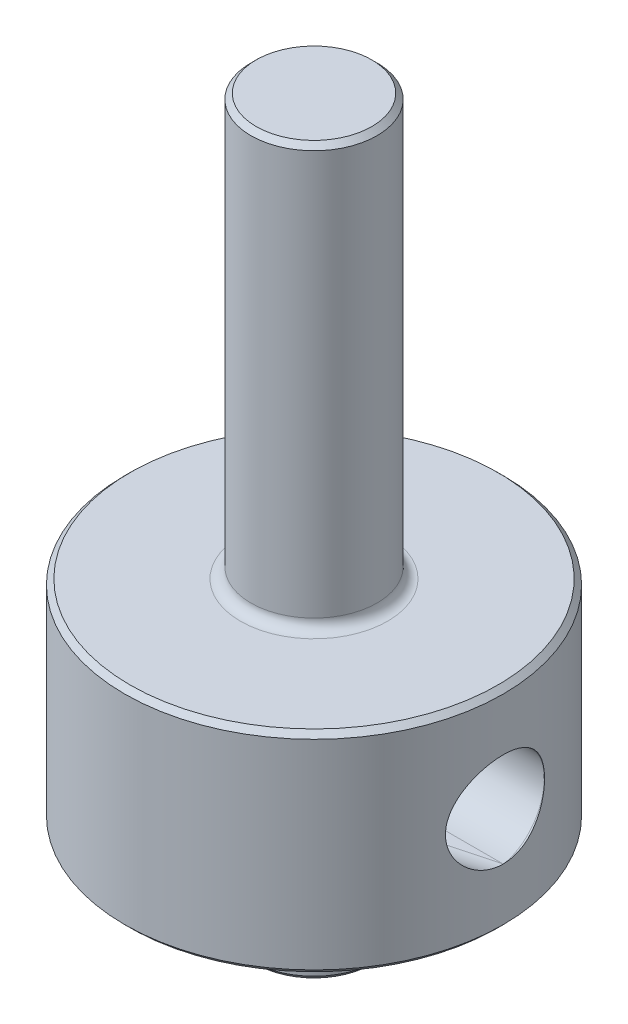
ISO-10303-21;
HEADER;
FILE_DESCRIPTION(('STEP AP214'),'2;1');
FILE_NAME('part.step','',(''),(''),'','','');
FILE_SCHEMA(('AUTOMOTIVE_DESIGN { 1 0 10303 214 1 1 1 1 }'));
ENDSEC;
DATA;
#1=APPLICATION_CONTEXT('core data for automotive mechanical design processes');
#2=APPLICATION_PROTOCOL_DEFINITION('international standard','automotive_design',2000,#1);
#3=PRODUCT_CONTEXT('',#1,'mechanical');
#4=PRODUCT('Part','Part','',(#3));
#5=PRODUCT_RELATED_PRODUCT_CATEGORY('part','',(#4));
#6=PRODUCT_DEFINITION_FORMATION('','',#4);
#7=PRODUCT_DEFINITION_CONTEXT('part definition',#1,'design');
#8=PRODUCT_DEFINITION('design','',#6,#7);
#9=PRODUCT_DEFINITION_SHAPE('','',#8);
#10=(LENGTH_UNIT() NAMED_UNIT(*) SI_UNIT(.MILLI.,.METRE.));
#11=(NAMED_UNIT(*) PLANE_ANGLE_UNIT() SI_UNIT($,.RADIAN.));
#12=(NAMED_UNIT(*) SI_UNIT($,.STERADIAN.) SOLID_ANGLE_UNIT());
#13=UNCERTAINTY_MEASURE_WITH_UNIT(LENGTH_MEASURE(1.E-05),#10,'distance_accuracy_value','');
#14=(GEOMETRIC_REPRESENTATION_CONTEXT(3) GLOBAL_UNCERTAINTY_ASSIGNED_CONTEXT((#13)) GLOBAL_UNIT_ASSIGNED_CONTEXT((#10,
#11,#12)) REPRESENTATION_CONTEXT('',''));
#15=CARTESIAN_POINT('',(0.,0.,0.));
#16=DIRECTION('',(0.,0.,1.));
#17=DIRECTION('',(1.,0.,0.));
#18=AXIS2_PLACEMENT_3D('',#15,#16,#17);
#19=CARTESIAN_POINT('',(11.25,0.,-0.602885682970027));
#20=DIRECTION('',(-0.965925826289068,0.,0.258819045102521));
#21=DIRECTION('',(0.258819045102521,0.,0.965925826289068));
#22=AXIS2_PLACEMENT_3D('',#19,#20,#21);
#23=CYLINDRICAL_SURFACE('',#22,2.25);
#24=DIRECTION('',(0.965925826289068,0.,-0.258819045102521));
#25=VECTOR('',#24,1.);
#26=CARTESIAN_POINT('',(-10.4287614698095,-2.25,5.20592094577239));
#27=LINE('',#26,#25);
#28=CARTESIAN_POINT('',(-7.79422863405994,-2.25,4.50000000000001));
#29=VERTEX_POINT('',#28);
#30=CARTESIAN_POINT('',(9.,-2.25,0.));
#31=VERTEX_POINT('',#30);
#32=EDGE_CURVE('E68',#29,#31,#27,.T.);
#33=ORIENTED_EDGE('',*,*,#32,.F.);
#34=CARTESIAN_POINT('',(-6.2986309684237,0.,6.42862721921359));
#35=CARTESIAN_POINT('',(-6.29863572562921,0.115420645557257,6.42862440706099));
#36=CARTESIAN_POINT('',(-6.3060602838156,0.230878962906398,6.42137370973188));
#37=CARTESIAN_POINT('',(-6.33512109848462,0.458218917145718,6.39270188036306));
#38=CARTESIAN_POINT('',(-6.3567683340453,0.570097720835036,6.37126980103204));
#39=CARTESIAN_POINT('',(-6.41242453029494,0.78670447934925,6.31524720562879));
#40=CARTESIAN_POINT('',(-6.44638221658226,0.891459984994621,6.2807112412774));
#41=CARTESIAN_POINT('',(-6.52441532590811,1.09212368629617,6.19960971245666));
#42=CARTESIAN_POINT('',(-6.56849300705771,1.18802990067239,6.15304146288881));
#43=CARTESIAN_POINT('',(-6.66787542719835,1.37599197932501,6.04526066182345));
#44=CARTESIAN_POINT('',(-6.72376022801728,1.46727267152965,5.98323478487839));
#45=CARTESIAN_POINT('',(-6.84174874506253,1.63651923315656,5.8479513900165));
#46=CARTESIAN_POINT('',(-6.90385527941814,1.71447902523652,5.77468877437664));
#47=CARTESIAN_POINT('',(-7.03939861788815,1.86424788131121,5.60888743463547));
#48=CARTESIAN_POINT('',(-7.11330801596242,1.93424855635128,5.51509447487221));
#49=CARTESIAN_POINT('',(-7.26276858582111,2.05452364569838,5.31673000401393));
#50=CARTESIAN_POINT('',(-7.33832026687979,2.1047918461138,5.2121551106831));
#51=CARTESIAN_POINT('',(-7.49057807446588,2.18518458802696,4.99097133267823));
#52=CARTESIAN_POINT('',(-7.56724722608848,2.2146353310375,4.87408964345249));
#53=CARTESIAN_POINT('',(-7.71646007617075,2.24913379886119,4.63423781835183));
#54=CARTESIAN_POINT('',(-7.78900533974565,2.25419084360776,4.51127002589661));
#55=CARTESIAN_POINT('',(-7.92385182822738,2.23921005722015,4.26974209030992));
#56=CARTESIAN_POINT('',(-7.98649124915509,2.22047892995192,4.15129057209001));
#57=CARTESIAN_POINT('',(-8.10419519406083,2.15996401217146,3.91653502097405));
#58=CARTESIAN_POINT('',(-8.15926253547756,2.11818882510589,3.80023020334988));
#59=CARTESIAN_POINT('',(-8.25776113353527,2.01560967239164,3.58092038777548));
#60=CARTESIAN_POINT('',(-8.30169093853679,1.95609127547807,3.47753592764894));
#61=CARTESIAN_POINT('',(-8.38164675783941,1.81895528829501,3.28014439330143));
#62=CARTESIAN_POINT('',(-8.4176735688114,1.74133952398132,3.18613637439842));
#63=CARTESIAN_POINT('',(-8.4813766537205,1.57178662880977,3.0124201997295));
#64=CARTESIAN_POINT('',(-8.50919398505658,1.48013832272008,2.93248136388814));
#65=CARTESIAN_POINT('',(-8.55778682532547,1.28408324493627,2.78749818442494));
#66=CARTESIAN_POINT('',(-8.5785620965331,1.17967604269037,2.72245434365095));
#67=CARTESIAN_POINT('',(-8.61377201375056,0.960065530946159,2.608929002455));
#68=CARTESIAN_POINT('',(-8.62815045340775,0.844776908229934,2.56059511952854));
#69=CARTESIAN_POINT('',(-8.65083340110135,0.607411382763265,2.48288750415837));
#70=CARTESIAN_POINT('',(-8.65913768828506,0.48533423335953,2.45351446112445));
#71=CARTESIAN_POINT('',(-8.67008048728678,0.236857570319108,2.41456499172959));
#72=CARTESIAN_POINT('',(-8.67267544790419,0.110432252928291,2.40514075696676));
#73=CARTESIAN_POINT('',(-8.67219751366162,-0.142268545365695,2.40686318857274));
#74=CARTESIAN_POINT('',(-8.66912451553204,-0.268544023496865,2.41801022974793));
#75=CARTESIAN_POINT('',(-8.65715387573318,-0.51751785461279,2.46052203867228));
#76=CARTESIAN_POINT('',(-8.64824925913011,-0.640211740022708,2.49191101619238));
#77=CARTESIAN_POINT('',(-8.62421236615811,-0.878377270072895,2.57386329992728));
#78=CARTESIAN_POINT('',(-8.60908000496078,-0.993848816312671,2.6244268673193));
#79=CARTESIAN_POINT('',(-8.57205213944146,-1.21415256544937,2.74294663140657));
#80=CARTESIAN_POINT('',(-8.55016367391666,-1.31899569116797,2.81088471402045));
#81=CARTESIAN_POINT('',(-8.49904486992793,-1.51515452308034,2.96185190294187));
#82=CARTESIAN_POINT('',(-8.46981504685822,-1.60647117817417,3.04487994975732));
#83=CARTESIAN_POINT('',(-8.40384326654009,-1.77231366502419,3.22246844850753));
#84=CARTESIAN_POINT('',(-8.36716006476566,-1.84696178407205,3.31693649876167));
#85=CARTESIAN_POINT('',(-8.28606008973115,-1.97828129373805,3.51462690249678));
#86=CARTESIAN_POINT('',(-8.24164420023817,-2.03495473659138,3.61784825487416));
#87=CARTESIAN_POINT('',(-8.14587050991866,-2.12853459341272,3.82858464031527));
#88=CARTESIAN_POINT('',(-8.09457748565701,-2.1656111713848,3.93605369911621));
#89=CARTESIAN_POINT('',(-7.98560105577117,-2.2201622548549,4.15269515826185));
#90=CARTESIAN_POINT('',(-7.92791726302396,-2.23763557216455,4.26186766144874));
#91=CARTESIAN_POINT('',(-7.8064627399753,-2.2532286711866,4.48051702474105));
#92=CARTESIAN_POINT('',(-7.74260781604153,-2.25102691326248,4.58996960492615));
#93=CARTESIAN_POINT('',(-7.61133141525705,-2.22723790138716,4.80452612877819));
#94=CARTESIAN_POINT('',(-7.54390907227507,-2.20564591918363,4.90962900524241));
#95=CARTESIAN_POINT('',(-7.40368700760956,-2.14247693844326,5.11880139853706));
#96=CARTESIAN_POINT('',(-7.33079536390484,-2.09986710762043,5.22249687911003));
#97=CARTESIAN_POINT('',(-7.18566990287537,-1.99573590270148,5.4204461433094));
#98=CARTESIAN_POINT('',(-7.11343636939443,-1.9342067325446,5.51469601343077));
#99=CARTESIAN_POINT('',(-6.96808985738204,-1.78946346248777,5.6973807162314));
#100=CARTESIAN_POINT('',(-6.89518353138152,-1.70517091423079,5.78512871402776));
#101=CARTESIAN_POINT('',(-6.75667498207226,-1.51863287423206,5.94631447067187));
#102=CARTESIAN_POINT('',(-6.69107582137067,-1.41637990076989,6.01974623884784));
#103=CARTESIAN_POINT('',(-6.57183008781377,-1.19703132919625,6.14969612074954));
#104=CARTESIAN_POINT('',(-6.51807249243096,-1.08009130507524,6.20637320763919));
#105=CARTESIAN_POINT('',(-6.42605821431225,-0.833521771282112,6.30160344845743));
#106=CARTESIAN_POINT('',(-6.38776882517395,-0.703919763209804,6.34019487118341));
#107=CARTESIAN_POINT('',(-6.33934183170501,-0.477861263387974,6.38854526595828));
#108=CARTESIAN_POINT('',(-6.32415889206565,-0.38356198653444,6.40353131951988));
#109=CARTESIAN_POINT('',(-6.30380294632094,-0.192850152597827,6.42357200922269));
#110=CARTESIAN_POINT('',(-6.29862699360223,-0.096438226055408,6.42862956887129));
#111=CARTESIAN_POINT('',(-6.2986309684237,0.,6.42862721921359));
#112=B_SPLINE_CURVE_WITH_KNOTS('',3,(#34,#35,#36,#37,#38,#39,#40,#41,#42,#43,#44,#45,#46,#47,
#48,#49,#50,#51,#52,#53,#54,#55,#56,#57,#58,#59,#60,#61,#62,#63,#64,#65,#66,#67,#68,#69,#70,#71,
#72,#73,#74,#75,#76,#77,#78,#79,#80,#81,#82,#83,#84,#85,#86,#87,#88,#89,#90,#91,#92,#93,#94,#95,
#96,#97,#98,#99,#100,#101,#102,#103,#104,#105,#106,#107,#108,#109,#110,#111),.UNSPECIFIED.,.T.,
.F.,(4,2,2,2,2,2,2,2,2,2,2,2,2,2,2,2,2,2,2,2,2,2,2,2,2,2,2,2,2,2,2,2,2,2,2,2,2,2,4),(0.,
0.345877961457703,0.692023234739048,1.03674303415902,1.38153982703779,1.75117699978304,
2.12098236297531,2.53438092029154,2.94790955541439,3.37427601824992,3.8004795692583,
4.204252580168,4.6078749452831,4.98738996171283,5.36686670307259,5.73938241737213,
6.11191070576972,6.48765054778276,6.86340405080125,7.24201403637019,7.62063092023952,
7.99970147963442,8.37877720253762,8.757459313711,9.13611484723242,9.51189379136419,
9.88762981596775,10.2600472924912,10.6324873406787,11.0110249766264,11.389654942997,
11.7890874589759,12.1886847895261,12.6122260505673,13.0359441651727,13.455502400953,
13.8741688086731,14.1632477952196,14.452241647867),.UNSPECIFIED.);
#113=CARTESIAN_POINT('',(-7.79422863405994,2.25,4.50000000000001));
#114=VERTEX_POINT('',#113);
#115=EDGE_CURVE('E100',#29,#114,#112,.T.);
#116=ORIENTED_EDGE('',*,*,#115,.T.);
#117=DIRECTION('',(0.965925826289068,0.,-0.258819045102521));
#118=VECTOR('',#117,1.);
#119=CARTESIAN_POINT('',(-10.4287614698095,2.25,5.20592094577239));
#120=LINE('',#119,#118);
#121=CARTESIAN_POINT('',(9.,2.25,0.));
#122=VERTEX_POINT('',#121);
#123=EDGE_CURVE('E96',#114,#122,#120,.T.);
#124=ORIENTED_EDGE('',*,*,#123,.T.);
#125=CARTESIAN_POINT('',(8.66908803732511,0.,2.41803899908722));
#126=CARTESIAN_POINT('',(8.66909075110963,-0.115420645557257,2.41803418508887));
#127=CARTESIAN_POINT('',(8.67189525844636,-0.230878962906399,2.40804261791352));
#128=CARTESIAN_POINT('',(8.68272674751999,-0.458218917145718,2.36868167797264));
#129=CARTESIAN_POINT('',(8.69075776377174,-0.570097720835037,2.33929733503571));
#130=CARTESIAN_POINT('',(8.71094614590031,-0.786704479349251,2.26295224610574));
#131=CARTESIAN_POINT('',(8.72308638270318,-0.891459984994622,2.21606438048958));
#132=CARTESIAN_POINT('',(8.75011427330529,-1.09212368629617,2.10681184158214));
#133=CARTESIAN_POINT('',(8.76500254013682,-1.18802990067239,2.04444371387181));
#134=CARTESIAN_POINT('',(8.79717984013551,-1.37599197932501,1.90141159203865));
#135=CARTESIAN_POINT('',(8.81456455885762,-1.46727267152965,1.81975320650276));
#136=CARTESIAN_POINT('',(8.84910391454271,-1.63651923315656,1.64360009131953));
#137=CARTESIAN_POINT('',(8.86625844321575,-1.71447902523652,1.54909953784991));
#138=CARTESIAN_POINT('',(8.90074174777394,-1.86424788131121,1.33773969641756));
#139=CARTESIAN_POINT('',(8.91785268420305,-1.93424855635128,1.21955791152931));
#140=CARTESIAN_POINT('',(8.94810709913564,-2.05452364569838,0.973038955628435));
#141=CARTESIAN_POINT('',(8.96124932756565,-2.1047918461138,0.844698600876546));
#142=CARTESIAN_POINT('',(8.9825165678573,-2.18518458802696,0.577018926426272));
#143=CARTESIAN_POINT('',(8.99047315623619,-2.21463533103751,0.437461838508236));
#144=CARTESIAN_POINT('',(8.99976936242818,-2.24913379886119,0.155137639785871));
#145=CARTESIAN_POINT('',(9.00111150738068,-2.25419084360776,0.0123717758849108));
#146=CARTESIAN_POINT('',(8.99712802422364,-2.23921005722015,-0.264220796297641));
#147=CARTESIAN_POINT('',(8.99214959491542,-2.22047892995192,-0.398122530656776));
#148=CARTESIAN_POINT('',(8.97670642577146,-2.15996401217146,-0.660278774055481));
#149=CARTESIAN_POINT('',(8.96624373354513,-2.11818882510589,-0.788535371408894));
#150=CARTESIAN_POINT('',(8.94189111391307,-2.01560967239164,-1.02771254202446));
#151=CARTESIAN_POINT('',(8.92824321096441,-1.95609127547807,-1.13921101335134));
#152=CARTESIAN_POINT('',(8.89879121448712,-1.81895528829501,-1.35013500623958));
#153=CARTESIAN_POINT('',(8.8829873385547,-1.74133952398132,-1.44956174425504));
#154=CARTESIAN_POINT('',(8.85129774105095,-1.57178662880977,-1.63185590702113));
#155=CARTESIAN_POINT('',(8.83541883873281,-1.48013832272008,-1.71499363527673));
#156=CARTESIAN_POINT('',(8.80500988311611,-1.28408324493627,-1.86484917194776));
#157=CARTESIAN_POINT('',(8.79047987536543,-1.17967604269037,-1.93156642602155));
#158=CARTESIAN_POINT('',(8.76420988754292,-0.960065530946158,-2.04748721407927));
#159=CARTESIAN_POINT('',(8.7524950400896,-0.844776908229933,-2.09653480438572));
#160=CARTESIAN_POINT('',(8.73328524133988,-0.607411382763264,-2.1751730472106));
#161=CARTESIAN_POINT('',(8.72579044348435,-0.485334233359529,-2.20476299225628));
#162=CARTESIAN_POINT('',(8.7157924507109,-0.236857570319107,-2.24396562171702));
#163=CARTESIAN_POINT('',(8.71332763514599,-0.110432252928291,-2.25342472874156));
#164=CARTESIAN_POINT('',(8.71377494775357,0.142268545365696,-2.25169409209321));
#165=CARTESIAN_POINT('',(8.71668717389518,0.268544023496866,-2.24050397219368));
#166=CARTESIAN_POINT('',(8.72757620019198,0.517517854612791,-2.19770234580494));
#167=CARTESIAN_POINT('',(8.73555906476282,0.64021174002271,-2.16606638557217));
#168=CARTESIAN_POINT('',(8.75571864668846,0.878377270072896,-2.08307517947359));
#169=CARTESIAN_POINT('',(8.76789542116834,0.993848816312672,-2.03171966500748));
#170=CARTESIAN_POINT('',(8.79508823102433,1.21415256544937,-1.91056460569769));
#171=CARTESIAN_POINT('',(8.81010130513694,1.31899569116797,-1.84078426750727));
#172=CARTESIAN_POINT('',(8.84131471673233,1.51515452308034,-1.68448344476903));
#173=CARTESIAN_POINT('',(8.85751497081356,1.60647117817417,-1.5979641354654));
#174=CARTESIAN_POINT('',(8.88917598250028,1.77231366502419,-1.41118209396871));
#175=CARTESIAN_POINT('',(8.90464142299854,1.84696178407205,-1.31102876171542));
#176=CARTESIAN_POINT('',(8.93325198623993,1.97828129373805,-1.09927386247916));
#177=CARTESIAN_POINT('',(8.94639737379601,2.03495473659138,-0.987673604360878));
#178=CARTESIAN_POINT('',(8.96882311768569,2.12853459341272,-0.757283695907411));
#179=CARTESIAN_POINT('',(8.97813658503864,2.1656111713848,-0.638566248734169));
#180=CARTESIAN_POINT('',(8.99208095791658,2.2201622548549,-0.396461026658194));
#181=CARTESIAN_POINT('',(8.99671157960431,2.23763557216455,-0.273072969130007));
#182=CARTESIAN_POINT('',(9.00085355888581,2.2532286711866,-0.0229898044732395));
#183=CARTESIAN_POINT('',(9.00027986269499,2.25102691326248,0.103726372443697));
#184=CARTESIAN_POINT('',(8.99386942662426,2.22723790138717,0.355175973039477));
#185=CARTESIAN_POINT('',(8.98803140305131,2.20564591918363,0.479908905559302));
#186=CARTESIAN_POINT('',(8.9711817295272,2.14247693844326,0.731168544255609));
#187=CARTESIAN_POINT('',(8.9599034546418,2.09986710762043,0.857417286541805));
#188=CARTESIAN_POINT('',(8.93319575075403,1.99573590270148,1.10140910851363));
#189=CARTESIAN_POINT('',(8.91776461081511,1.9342067325446,1.21914865708259));
#190=CARTESIAN_POINT('',(8.88323319046123,1.78946346248777,1.45003150659694));
#191=CARTESIAN_POINT('',(8.86396845894638,1.70517091423079,1.56247666482007));
#192=CARTESIAN_POINT('',(8.82460941492528,1.51863287423205,1.77132189945671));
#193=CARTESIAN_POINT('',(8.80451475937875,1.41637990076989,1.86771525649271));
#194=CARTESIAN_POINT('',(8.76621986577641,1.19703132919625,2.03987802221683));
#195=CARTESIAN_POINT('',(8.74800296597337,1.08009130507523,2.11584061696716));
#196=CARTESIAN_POINT('',(8.71593138402079,0.83352177128211,2.24431956378361));
#197=CARTESIAN_POINT('',(8.70206751169463,0.703919763209803,2.29688541080165));
#198=CARTESIAN_POINT('',(8.68430370250905,0.477861263387973,2.36297157769416));
#199=CARTESIAN_POINT('',(8.67864791785805,0.383561986534439,2.38354135060067));
#200=CARTESIAN_POINT('',(8.67103949657648,0.192850152597826,2.41107506986501));
#201=CARTESIAN_POINT('',(8.66908576985758,0.0964382260554076,2.41804302136122));
#202=CARTESIAN_POINT('',(8.66908803732511,0.,2.41803899908722));
#203=B_SPLINE_CURVE_WITH_KNOTS('',3,(#125,#126,#127,#128,#129,#130,#131,#132,#133,#134,#135,
#136,#137,#138,#139,#140,#141,#142,#143,#144,#145,#146,#147,#148,#149,#150,#151,#152,#153,#154,
#155,#156,#157,#158,#159,#160,#161,#162,#163,#164,#165,#166,#167,#168,#169,#170,#171,#172,#173,
#174,#175,#176,#177,#178,#179,#180,#181,#182,#183,#184,#185,#186,#187,#188,#189,#190,#191,#192,
#193,#194,#195,#196,#197,#198,#199,#200,#201,#202),.UNSPECIFIED.,.T.,.F.,(4,2,2,2,2,2,2,2,2,2,2,
2,2,2,2,2,2,2,2,2,2,2,2,2,2,2,2,2,2,2,2,2,2,2,2,2,2,2,4),(0.,0.345877961457704,
0.692023234739048,1.03674303415902,1.38153982703779,1.75117699978304,2.12098236297532,
2.53438092029155,2.94790955541439,3.37427601824992,3.8004795692583,4.204252580168,
4.6078749452831,4.98738996171283,5.36686670307259,5.73938241737213,6.11191070576972,
6.48765054778276,6.86340405080125,7.24201403637019,7.62063092023952,7.99970147963442,
8.37877720253762,8.75745931371099,9.13611484723242,9.51189379136419,9.88762981596774,
10.2600472924912,10.6324873406787,11.0110249766264,11.389654942997,11.7890874589759,
12.1886847895261,12.6122260505673,13.0359441651727,13.455502400953,13.8741688086731,
14.1632477952196,14.452241647867),.UNSPECIFIED.);
#204=EDGE_CURVE('E95',#122,#31,#203,.T.);
#205=ORIENTED_EDGE('',*,*,#204,.T.);
#206=EDGE_LOOP('',(#33,#116,#124,#205));
#207=FACE_BOUND('',#206,.T.);
#208=ADVANCED_FACE('F36',(#207),#23,.F.);
#209=CARTESIAN_POINT('',(3.,-9.5,0.));
#210=DIRECTION('',(0.,-1.,0.));
#211=DIRECTION('',(0.,0.,-1.));
#212=AXIS2_PLACEMENT_3D('',#209,#210,#211);
#213=PLANE('',#212);
#214=CARTESIAN_POINT('',(0.,-9.5,0.));
#215=DIRECTION('',(0.,-1.,0.));
#216=DIRECTION('',(0.,0.,-1.));
#217=AXIS2_PLACEMENT_3D('',#214,#215,#216);
#218=CIRCLE('',#217,2.75);
#219=CARTESIAN_POINT('',(0.,-9.5,-2.75));
#220=VERTEX_POINT('',#219);
#221=EDGE_CURVE('E139',#220,#220,#218,.T.);
#222=ORIENTED_EDGE('',*,*,#221,.T.);
#223=EDGE_LOOP('',(#222));
#224=FACE_BOUND('',#223,.T.);
#225=ADVANCED_FACE('F184',(#224),#213,.T.);
#226=CARTESIAN_POINT('',(0.,25.,0.));
#227=DIRECTION('',(0.,1.,0.));
#228=DIRECTION('',(0.,0.,1.));
#229=AXIS2_PLACEMENT_3D('',#226,#227,#228);
#230=PLANE('',#229);
#231=CARTESIAN_POINT('',(0.,25.,0.));
#232=DIRECTION('',(0.,1.,0.));
#233=DIRECTION('',(0.,0.,1.));
#234=AXIS2_PLACEMENT_3D('',#231,#232,#233);
#235=CIRCLE('',#234,2.75);
#236=CARTESIAN_POINT('',(0.,25.,2.75));
#237=VERTEX_POINT('',#236);
#238=EDGE_CURVE('E148',#237,#237,#235,.T.);
#239=ORIENTED_EDGE('',*,*,#238,.T.);
#240=EDGE_LOOP('',(#239));
#241=FACE_BOUND('',#240,.T.);
#242=ADVANCED_FACE('F188',(#241),#230,.T.);
#243=CARTESIAN_POINT('',(0.,0.,0.));
#244=DIRECTION('',(0.,-1.,0.));
#245=DIRECTION('',(0.,0.,-1.));
#246=AXIS2_PLACEMENT_3D('',#243,#244,#245);
#247=CYLINDRICAL_SURFACE('',#246,3.);
#248=CARTESIAN_POINT('',(0.,24.75,0.));
#249=DIRECTION('',(0.,1.,0.));
#250=DIRECTION('',(0.,0.,1.));
#251=AXIS2_PLACEMENT_3D('',#248,#249,#250);
#252=CIRCLE('',#251,3.);
#253=CARTESIAN_POINT('',(0.,24.75,3.));
#254=VERTEX_POINT('',#253);
#255=EDGE_CURVE('E145',#254,#254,#252,.F.);
#256=ORIENTED_EDGE('',*,*,#255,.T.);
#257=EDGE_LOOP('',(#256));
#258=FACE_BOUND('',#257,.T.);
#259=CARTESIAN_POINT('',(0.,5.5,0.));
#260=DIRECTION('',(0.,1.,0.));
#261=DIRECTION('',(0.,0.,1.));
#262=AXIS2_PLACEMENT_3D('',#259,#260,#261);
#263=CIRCLE('',#262,3.);
#264=CARTESIAN_POINT('',(0.,5.5,3.));
#265=VERTEX_POINT('',#264);
#266=EDGE_CURVE('E136',#265,#265,#263,.T.);
#267=ORIENTED_EDGE('',*,*,#266,.T.);
#268=EDGE_LOOP('',(#267));
#269=FACE_BOUND('',#268,.T.);
#270=ADVANCED_FACE('F194',(#258,#269),#247,.T.);
#271=CARTESIAN_POINT('',(9.,5.,0.));
#272=DIRECTION('',(0.,1.,0.));
#273=DIRECTION('',(0.,0.,1.));
#274=AXIS2_PLACEMENT_3D('',#271,#272,#273);
#275=PLANE('',#274);
#276=CARTESIAN_POINT('',(0.,5.,0.));
#277=DIRECTION('',(0.,1.,0.));
#278=DIRECTION('',(0.,0.,1.));
#279=AXIS2_PLACEMENT_3D('',#276,#277,#278);
#280=CIRCLE('',#279,8.75);
#281=CARTESIAN_POINT('',(0.,5.,8.75));
#282=VERTEX_POINT('',#281);
#283=EDGE_CURVE('E11',#282,#282,#280,.T.);
#284=ORIENTED_EDGE('',*,*,#283,.T.);
#285=EDGE_LOOP('',(#284));
#286=FACE_BOUND('',#285,.T.);
#287=CARTESIAN_POINT('',(0.,5.,0.));
#288=DIRECTION('',(0.,1.,0.));
#289=DIRECTION('',(0.,0.,1.));
#290=AXIS2_PLACEMENT_3D('',#287,#288,#289);
#291=CIRCLE('',#290,3.5);
#292=CARTESIAN_POINT('',(0.,5.,3.5));
#293=VERTEX_POINT('',#292);
#294=EDGE_CURVE('E133',#293,#293,#291,.F.);
#295=ORIENTED_EDGE('',*,*,#294,.T.);
#296=EDGE_LOOP('',(#295));
#297=FACE_BOUND('',#296,.T.);
#298=ADVANCED_FACE('F216',(#286,#297),#275,.T.);
#299=CARTESIAN_POINT('',(0.,0.,0.));
#300=DIRECTION('',(0.,-1.,0.));
#301=DIRECTION('',(0.,0.,-1.));
#302=AXIS2_PLACEMENT_3D('',#299,#300,#301);
#303=CYLINDRICAL_SURFACE('',#302,9.);
#304=CARTESIAN_POINT('',(0.,-4.75,0.));
#305=DIRECTION('',(0.,-1.,0.));
#306=DIRECTION('',(0.,0.,-1.));
#307=AXIS2_PLACEMENT_3D('',#304,#305,#306);
#308=CIRCLE('',#307,9.);
#309=CARTESIAN_POINT('',(0.,-4.75,-9.));
#310=VERTEX_POINT('',#309);
#311=EDGE_CURVE('E44',#310,#310,#308,.F.);
#312=ORIENTED_EDGE('',*,*,#311,.T.);
#313=EDGE_LOOP('',(#312));
#314=FACE_BOUND('',#313,.T.);
#315=CARTESIAN_POINT('',(0.,4.75,0.));
#316=DIRECTION('',(0.,1.,0.));
#317=DIRECTION('',(0.,0.,1.));
#318=AXIS2_PLACEMENT_3D('',#315,#316,#317);
#319=CIRCLE('',#318,9.);
#320=CARTESIAN_POINT('',(0.,4.75,9.));
#321=VERTEX_POINT('',#320);
#322=EDGE_CURVE('E154',#321,#321,#319,.F.);
#323=ORIENTED_EDGE('',*,*,#322,.T.);
#324=EDGE_LOOP('',(#323));
#325=FACE_BOUND('',#324,.T.);
#326=CARTESIAN_POINT('',(0.,-2.25,0.));
#327=DIRECTION('',(0.,-1.,0.));
#328=DIRECTION('',(0.,0.,-1.));
#329=AXIS2_PLACEMENT_3D('',#326,#327,#328);
#330=CIRCLE('',#329,9.);
#331=CARTESIAN_POINT('',(-9.,-2.25,0.));
#332=VERTEX_POINT('',#331);
#333=EDGE_CURVE('E51',#332,#29,#330,.F.);
#334=ORIENTED_EDGE('',*,*,#333,.F.);
#335=CARTESIAN_POINT('',(-8.71421252896669,0.,2.25));
#336=CARTESIAN_POINT('',(-8.71421490079074,0.124245675833919,2.24999647073377));
#337=CARTESIAN_POINT('',(-8.71689875413138,0.24853040881067,2.23967362094789));
#338=CARTESIAN_POINT('',(-8.72731675793308,0.493530820356158,2.19872081291741));
#339=CARTESIAN_POINT('',(-8.73505384759467,0.614244379021367,2.16807903606789));
#340=CARTESIAN_POINT('',(-8.75464852136535,0.848523184368464,2.08754207966884));
#341=CARTESIAN_POINT('',(-8.76650078421412,0.962097439847137,2.03767175506904));
#342=CARTESIAN_POINT('',(-8.79298372825883,1.17927976728589,1.92016902713525));
#343=CARTESIAN_POINT('',(-8.8076145274064,1.2828874158722,1.85253586970462));
#344=CARTESIAN_POINT('',(-8.83836644720063,1.47947548073599,1.69983758458069));
#345=CARTESIAN_POINT('',(-8.85451137860731,1.57220424031504,1.61445319893365));
#346=CARTESIAN_POINT('',(-8.88626587963764,1.74218525492431,1.4293638576906));
#347=CARTESIAN_POINT('',(-8.9018753990975,1.81943606305957,1.32965756476228));
#348=CARTESIAN_POINT('',(-8.93106373968524,1.95729792086815,1.11703068097106));
#349=CARTESIAN_POINT('',(-8.94461118660533,2.01766174934532,1.00394511857561));
#350=CARTESIAN_POINT('',(-8.96787730733386,2.11842867973777,0.768836865863486));
#351=CARTESIAN_POINT('',(-8.9775965460091,2.15883472672396,0.646815497212746));
#352=CARTESIAN_POINT('',(-8.99194282963362,2.21773305112073,0.399922882878745));
#353=CARTESIAN_POINT('',(-8.99666904459883,2.23665267989392,0.275159447594078));
#354=CARTESIAN_POINT('',(-9.00084234696568,2.253382541348,0.0241459373364922));
#355=CARTESIAN_POINT('',(-9.00029021487034,2.25119589498864,-0.102103915084262));
#356=CARTESIAN_POINT('',(-8.9940428545818,2.22608263477487,-0.349542556137872));
#357=CARTESIAN_POINT('',(-8.98846202106784,2.20361730745153,-0.470781485102401));
#358=CARTESIAN_POINT('',(-8.97291752872371,2.13932585695635,-0.707711056680794));
#359=CARTESIAN_POINT('',(-8.96295363658607,2.09749870316033,-0.823401403583486));
#360=CARTESIAN_POINT('',(-8.93958758730796,1.99529768638164,-1.04716508287906));
#361=CARTESIAN_POINT('',(-8.9261551772551,1.93475965980443,-1.15516014697463));
#362=CARTESIAN_POINT('',(-8.89730913428723,1.79697988879537,-1.3596201502661));
#363=CARTESIAN_POINT('',(-8.88189515687385,1.71973523829544,-1.45608307894239));
#364=CARTESIAN_POINT('',(-8.85027342392421,1.54826213221587,-1.63749157894115));
#365=CARTESIAN_POINT('',(-8.83405547572768,1.45363059688703,-1.72205477791919));
#366=CARTESIAN_POINT('',(-8.80303539165594,1.25136002381375,-1.8741968459168));
#367=CARTESIAN_POINT('',(-8.7882333219746,1.14372037845801,-1.94177492110356));
#368=CARTESIAN_POINT('',(-8.76168447146387,0.917738969266025,-2.05827329030082));
#369=CARTESIAN_POINT('',(-8.74995285345307,0.799347842718476,-2.10710152568351));
#370=CARTESIAN_POINT('',(-8.73106776133802,0.55567307873084,-2.18404264643186));
#371=CARTESIAN_POINT('',(-8.7239133075846,0.430390922413862,-2.21215996474439));
#372=CARTESIAN_POINT('',(-8.71519820406711,0.180036448623073,-2.24624667479933));
#373=CARTESIAN_POINT('',(-8.7134948007924,0.0550459859930781,-2.25278142652721));
#374=CARTESIAN_POINT('',(-8.71548609028223,-0.194239742926729,-2.24506529146364));
#375=CARTESIAN_POINT('',(-8.7191802861327,-0.318535072154498,-2.23081631806482));
#376=CARTESIAN_POINT('',(-8.73141373786482,-0.560802838453716,-2.18243291754443));
#377=CARTESIAN_POINT('',(-8.73987273218279,-0.678845453912279,-2.14862766145371));
#378=CARTESIAN_POINT('',(-8.76060646436524,-0.907588312067995,-2.06245627350342));
#379=CARTESIAN_POINT('',(-8.77288165421767,-1.01828768315021,-2.01008794294125));
#380=CARTESIAN_POINT('',(-8.8001652338596,-1.23159715008021,-1.88709360114294));
#381=CARTESIAN_POINT('',(-8.8152225174652,-1.33400595603868,-1.81612957845208));
#382=CARTESIAN_POINT('',(-8.84625374764002,-1.52566952652133,-1.65838565910251));
#383=CARTESIAN_POINT('',(-8.86222784455476,-1.6149221249851,-1.57160316331224));
#384=CARTESIAN_POINT('',(-8.89377662728596,-1.78002993831383,-1.38209112221564));
#385=CARTESIAN_POINT('',(-8.90933131855692,-1.85549405629392,-1.27901689319608));
#386=CARTESIAN_POINT('',(-8.93787494952321,-1.98804228025613,-1.06133103606302));
#387=CARTESIAN_POINT('',(-8.95086402303554,-2.04512734494739,-0.94672001015458));
#388=CARTESIAN_POINT('',(-8.97273104164493,-2.13880143107514,-0.710005953894954));
#389=CARTESIAN_POINT('',(-8.98163847020169,-2.17553785594116,-0.587964107312736));
#390=CARTESIAN_POINT('',(-8.9944676405621,-2.22791430114757,-0.339186960717317));
#391=CARTESIAN_POINT('',(-8.99839034454079,-2.24355839286514,-0.212452571342792));
#392=CARTESIAN_POINT('',(-9.00076881169814,-2.25307707654496,0.0384379344974772));
#393=CARTESIAN_POINT('',(-8.99936952479974,-2.24752884546467,0.162571110673549));
#394=CARTESIAN_POINT('',(-8.99158267029248,-2.21614238858771,0.40807686693319));
#395=CARTESIAN_POINT('',(-8.9851952510363,-2.19030476622037,0.529449529007089));
#396=CARTESIAN_POINT('',(-8.9681722392125,-2.11938250551556,0.765384830200741));
#397=CARTESIAN_POINT('',(-8.95755970130383,-2.07440223004265,0.879980612806941));
#398=CARTESIAN_POINT('',(-8.9332040005573,-1.96656619720596,1.10006336934365));
#399=CARTESIAN_POINT('',(-8.91946044312205,-1.90370818649141,1.20554919284767));
#400=CARTESIAN_POINT('',(-8.88991311780646,-1.7601407235087,1.40715433895243));
#401=CARTESIAN_POINT('',(-8.87406788118745,-1.67903967846638,1.50298872367125));
#402=CARTESIAN_POINT('',(-8.84228960378677,-1.50204858305097,1.67988379561538));
#403=CARTESIAN_POINT('',(-8.8263565417643,-1.40615478874988,1.76094073142233));
#404=CARTESIAN_POINT('',(-8.7958682065238,-1.20014681807371,1.90746455956162));
#405=CARTESIAN_POINT('',(-8.781344182649,-1.08980072242818,1.97261239368685));
#406=CARTESIAN_POINT('',(-8.75573899863363,-0.859375147781657,2.08333551731731));
#407=CARTESIAN_POINT('',(-8.74465533524731,-0.739302826288846,2.12892504694234));
#408=CARTESIAN_POINT('',(-8.72891794689159,-0.516201723370889,2.19245068928476));
#409=CARTESIAN_POINT('',(-8.72344491757872,-0.414240380131192,2.21398463384298));
#410=CARTESIAN_POINT('',(-8.71609136810895,-0.208195044755202,2.24276015828648));
#411=CARTESIAN_POINT('',(-8.71421054150493,-0.104111234450095,2.25000295733644));
#412=CARTESIAN_POINT('',(-8.71421252896669,0.,2.25));
#413=B_SPLINE_CURVE_WITH_KNOTS('',3,(#335,#336,#337,#338,#339,#340,#341,#342,#343,#344,#345,
#346,#347,#348,#349,#350,#351,#352,#353,#354,#355,#356,#357,#358,#359,#360,#361,#362,#363,#364,
#365,#366,#367,#368,#369,#370,#371,#372,#373,#374,#375,#376,#377,#378,#379,#380,#381,#382,#383,
#384,#385,#386,#387,#388,#389,#390,#391,#392,#393,#394,#395,#396,#397,#398,#399,#400,#401,#402,
#403,#404,#405,#406,#407,#408,#409,#410,#411,#412),.UNSPECIFIED.,.T.,.F.,(4,2,2,2,2,2,2,2,2,2,2,
2,2,2,2,2,2,2,2,2,2,2,2,2,2,2,2,2,2,2,2,2,2,2,2,2,2,2,4),(0.,0.372354697562523,0.7449261672858,
1.11701765444942,1.48912494079931,1.86861558773678,2.2481416933188,2.63296346758128,
3.01772843862383,3.39469875895812,3.77161333799418,4.14016436420052,4.50873501052307,
4.88063586829,5.25260146922022,5.6346341991472,6.01668478079822,6.40058788807562,
6.78440880116593,7.15809217287784,7.53174114469872,7.89927664512737,8.26685569283726,
8.64164561277692,9.0164971700099,9.40072797873237,9.78493874152048,10.1663286553069,
10.5476449402258,10.9186510151916,11.2896460564373,11.6586438890819,12.0276882516872,
12.4055738692831,12.7835552841341,13.1685882956202,13.5533404923751,13.8653804446715,
14.1773937759712),.UNSPECIFIED.);
#414=CARTESIAN_POINT('',(-9.,2.25,0.));
#415=VERTEX_POINT('',#414);
#416=EDGE_CURVE('E85',#415,#332,#413,.T.);
#417=ORIENTED_EDGE('',*,*,#416,.F.);
#418=CARTESIAN_POINT('',(0.,2.25,0.));
#419=DIRECTION('',(0.,-1.,0.));
#420=DIRECTION('',(0.,0.,-1.));
#421=AXIS2_PLACEMENT_3D('',#418,#419,#420);
#422=CIRCLE('',#421,9.);
#423=EDGE_CURVE('E86',#415,#114,#422,.F.);
#424=ORIENTED_EDGE('',*,*,#423,.T.);
#425=ORIENTED_EDGE('',*,*,#115,.F.);
#426=EDGE_LOOP('',(#334,#417,#424,#425));
#427=FACE_BOUND('',#426,.T.);
#428=EDGE_CURVE('E91',#31,#122,#203,.T.);
#429=ORIENTED_EDGE('',*,*,#428,.F.);
#430=ORIENTED_EDGE('',*,*,#204,.F.);
#431=EDGE_LOOP('',(#429,#430));
#432=FACE_BOUND('',#431,.T.);
#433=ADVANCED_FACE('F99',(#314,#325,#427,#432),#303,.T.);
#434=CARTESIAN_POINT('',(3.,-5.,0.));
#435=DIRECTION('',(0.,-1.,0.));
#436=DIRECTION('',(0.,0.,-1.));
#437=AXIS2_PLACEMENT_3D('',#434,#435,#436);
#438=PLANE('',#437);
#439=CARTESIAN_POINT('',(0.,-5.,0.));
#440=DIRECTION('',(0.,-1.,0.));
#441=DIRECTION('',(0.,0.,-1.));
#442=AXIS2_PLACEMENT_3D('',#439,#440,#441);
#443=CIRCLE('',#442,8.75);
#444=CARTESIAN_POINT('',(0.,-5.,-8.75));
#445=VERTEX_POINT('',#444);
#446=EDGE_CURVE('E151',#445,#445,#443,.T.);
#447=ORIENTED_EDGE('',*,*,#446,.T.);
#448=EDGE_LOOP('',(#447));
#449=FACE_BOUND('',#448,.T.);
#450=CARTESIAN_POINT('',(0.,-5.,0.));
#451=DIRECTION('',(0.,-1.,0.));
#452=DIRECTION('',(0.,0.,-1.));
#453=AXIS2_PLACEMENT_3D('',#450,#451,#452);
#454=CIRCLE('',#453,3.5);
#455=CARTESIAN_POINT('',(0.,-5.,-3.5));
#456=VERTEX_POINT('',#455);
#457=EDGE_CURVE('E130',#456,#456,#454,.F.);
#458=ORIENTED_EDGE('',*,*,#457,.T.);
#459=EDGE_LOOP('',(#458));
#460=FACE_BOUND('',#459,.T.);
#461=ADVANCED_FACE('F167',(#449,#460),#438,.T.);
#462=CARTESIAN_POINT('',(0.,0.,0.));
#463=DIRECTION('',(0.,-1.,0.));
#464=DIRECTION('',(0.,0.,-1.));
#465=AXIS2_PLACEMENT_3D('',#462,#463,#464);
#466=CYLINDRICAL_SURFACE('',#465,3.);
#467=CARTESIAN_POINT('',(0.,-9.25,0.));
#468=DIRECTION('',(0.,-1.,0.));
#469=DIRECTION('',(0.,0.,-1.));
#470=AXIS2_PLACEMENT_3D('',#467,#468,#469);
#471=CIRCLE('',#470,3.);
#472=CARTESIAN_POINT('',(0.,-9.25,-3.));
#473=VERTEX_POINT('',#472);
#474=EDGE_CURVE('E142',#473,#473,#471,.F.);
#475=ORIENTED_EDGE('',*,*,#474,.T.);
#476=EDGE_LOOP('',(#475));
#477=FACE_BOUND('',#476,.T.);
#478=CARTESIAN_POINT('',(0.,-5.5,0.));
#479=DIRECTION('',(0.,-1.,0.));
#480=DIRECTION('',(0.,0.,-1.));
#481=AXIS2_PLACEMENT_3D('',#478,#479,#480);
#482=CIRCLE('',#481,3.);
#483=CARTESIAN_POINT('',(0.,-5.5,-3.));
#484=VERTEX_POINT('',#483);
#485=EDGE_CURVE('E93',#484,#484,#482,.T.);
#486=ORIENTED_EDGE('',*,*,#485,.T.);
#487=EDGE_LOOP('',(#486));
#488=FACE_BOUND('',#487,.T.);
#489=ADVANCED_FACE('F124',(#477,#488),#466,.T.);
#490=CARTESIAN_POINT('',(9.,0.,0.));
#491=DIRECTION('',(-1.,0.,0.));
#492=DIRECTION('',(0.,0.,1.));
#493=AXIS2_PLACEMENT_3D('',#490,#491,#492);
#494=CYLINDRICAL_SURFACE('',#493,2.25);
#495=ORIENTED_EDGE('',*,*,#416,.T.);
#496=DIRECTION('',(-1.,0.,0.));
#497=VECTOR('',#496,1.);
#498=CARTESIAN_POINT('',(9.,-2.25,0.));
#499=LINE('',#498,#497);
#500=EDGE_CURVE('E71',#31,#332,#499,.T.);
#501=ORIENTED_EDGE('',*,*,#500,.F.);
#502=CARTESIAN_POINT('',(9.00000000000001,0.,0.));
#503=DIRECTION('',(-0.99144486137381,0.,0.130526192220052));
#504=DIRECTION('',(-0.130526192220052,0.,-0.99144486137381));
#505=AXIS2_PLACEMENT_3D('',#502,#503,#504);
#506=ELLIPSE('',#505,2.26941516130534,2.25);
#507=EDGE_CURVE('E82',#31,#122,#506,.F.);
#508=ORIENTED_EDGE('',*,*,#507,.T.);
#509=DIRECTION('',(-1.,0.,0.));
#510=VECTOR('',#509,1.);
#511=CARTESIAN_POINT('',(9.,2.25,0.));
#512=LINE('',#511,#510);
#513=EDGE_CURVE('E59',#122,#415,#512,.T.);
#514=ORIENTED_EDGE('',*,*,#513,.T.);
#515=EDGE_LOOP('',(#495,#501,#508,#514));
#516=FACE_BOUND('',#515,.T.);
#517=ADVANCED_FACE('F81',(#516),#494,.F.);
#518=ORIENTED_EDGE('',*,*,#428,.T.);
#519=ORIENTED_EDGE('',*,*,#507,.F.);
#520=EDGE_LOOP('',(#518,#519));
#521=FACE_BOUND('',#520,.T.);
#522=ADVANCED_FACE('F89',(#521),#23,.F.);
#523=CARTESIAN_POINT('',(0.,2.25,0.));
#524=DIRECTION('',(0.,-1.,0.));
#525=DIRECTION('',(0.,0.,-1.));
#526=AXIS2_PLACEMENT_3D('',#523,#524,#525);
#527=PLANE('',#526);
#528=ORIENTED_EDGE('',*,*,#513,.F.);
#529=ORIENTED_EDGE('',*,*,#123,.F.);
#530=ORIENTED_EDGE('',*,*,#423,.F.);
#531=EDGE_LOOP('',(#528,#529,#530));
#532=FACE_BOUND('',#531,.T.);
#533=ADVANCED_FACE('F118',(#532),#527,.T.);
#534=CARTESIAN_POINT('',(0.,-2.25,0.));
#535=DIRECTION('',(0.,-1.,0.));
#536=DIRECTION('',(0.,0.,-1.));
#537=AXIS2_PLACEMENT_3D('',#534,#535,#536);
#538=PLANE('',#537);
#539=ORIENTED_EDGE('',*,*,#333,.T.);
#540=ORIENTED_EDGE('',*,*,#32,.T.);
#541=ORIENTED_EDGE('',*,*,#500,.T.);
#542=EDGE_LOOP('',(#539,#540,#541));
#543=FACE_BOUND('',#542,.T.);
#544=ADVANCED_FACE('F70',(#543),#538,.F.);
#545=CARTESIAN_POINT('',(0.,-5.5,0.));
#546=DIRECTION('',(0.,-1.,0.));
#547=DIRECTION('',(0.,0.,-1.));
#548=AXIS2_PLACEMENT_3D('',#545,#546,#547);
#549=TOROIDAL_SURFACE('',#548,3.5,0.5);
#550=ORIENTED_EDGE('',*,*,#457,.F.);
#551=EDGE_LOOP('',(#550));
#552=FACE_BOUND('',#551,.T.);
#553=ORIENTED_EDGE('',*,*,#485,.F.);
#554=EDGE_LOOP('',(#553));
#555=FACE_BOUND('',#554,.T.);
#556=ADVANCED_FACE('F172',(#552,#555),#549,.F.);
#557=CARTESIAN_POINT('',(0.,5.5,0.));
#558=DIRECTION('',(0.,1.,0.));
#559=DIRECTION('',(0.,0.,1.));
#560=AXIS2_PLACEMENT_3D('',#557,#558,#559);
#561=TOROIDAL_SURFACE('',#560,3.5,0.5);
#562=ORIENTED_EDGE('',*,*,#266,.F.);
#563=EDGE_LOOP('',(#562));
#564=FACE_BOUND('',#563,.T.);
#565=ORIENTED_EDGE('',*,*,#294,.F.);
#566=EDGE_LOOP('',(#565));
#567=FACE_BOUND('',#566,.T.);
#568=ADVANCED_FACE('F175',(#564,#567),#561,.F.);
#569=CARTESIAN_POINT('',(0.,-9.5,0.));
#570=DIRECTION('',(0.,1.,0.));
#571=DIRECTION('',(0.,0.,1.));
#572=AXIS2_PLACEMENT_3D('',#569,#570,#571);
#573=CONICAL_SURFACE('',#572,2.75,0.785398163397453);
#574=ORIENTED_EDGE('',*,*,#474,.F.);
#575=EDGE_LOOP('',(#574));
#576=FACE_BOUND('',#575,.T.);
#577=ORIENTED_EDGE('',*,*,#221,.F.);
#578=EDGE_LOOP('',(#577));
#579=FACE_BOUND('',#578,.T.);
#580=ADVANCED_FACE('F201',(#576,#579),#573,.T.);
#581=CARTESIAN_POINT('',(0.,24.75,0.));
#582=DIRECTION('',(0.,-1.,0.));
#583=DIRECTION('',(0.,0.,-1.));
#584=AXIS2_PLACEMENT_3D('',#581,#582,#583);
#585=CONICAL_SURFACE('',#584,3.,0.785398163397448);
#586=ORIENTED_EDGE('',*,*,#238,.F.);
#587=EDGE_LOOP('',(#586));
#588=FACE_BOUND('',#587,.T.);
#589=ORIENTED_EDGE('',*,*,#255,.F.);
#590=EDGE_LOOP('',(#589));
#591=FACE_BOUND('',#590,.T.);
#592=ADVANCED_FACE('F164',(#588,#591),#585,.T.);
#593=CARTESIAN_POINT('',(0.,-5.,0.));
#594=DIRECTION('',(0.,1.,0.));
#595=DIRECTION('',(0.,0.,1.));
#596=AXIS2_PLACEMENT_3D('',#593,#594,#595);
#597=CONICAL_SURFACE('',#596,8.75,0.785398163397448);
#598=ORIENTED_EDGE('',*,*,#311,.F.);
#599=EDGE_LOOP('',(#598));
#600=FACE_BOUND('',#599,.T.);
#601=ORIENTED_EDGE('',*,*,#446,.F.);
#602=EDGE_LOOP('',(#601));
#603=FACE_BOUND('',#602,.T.);
#604=ADVANCED_FACE('F161',(#600,#603),#597,.T.);
#605=CARTESIAN_POINT('',(0.,4.75,0.));
#606=DIRECTION('',(0.,-1.,0.));
#607=DIRECTION('',(0.,0.,-1.));
#608=AXIS2_PLACEMENT_3D('',#605,#606,#607);
#609=CONICAL_SURFACE('',#608,9.,0.785398163397448);
#610=ORIENTED_EDGE('',*,*,#283,.F.);
#611=EDGE_LOOP('',(#610));
#612=FACE_BOUND('',#611,.T.);
#613=ORIENTED_EDGE('',*,*,#322,.F.);
#614=EDGE_LOOP('',(#613));
#615=FACE_BOUND('',#614,.T.);
#616=ADVANCED_FACE('F38',(#612,#615),#609,.T.);
#617=CLOSED_SHELL('',(#208,#225,#242,#270,#298,#433,#461,#489,#517,#522,#533,#544,#556,#568,
#580,#592,#604,#616));
#618=MANIFOLD_SOLID_BREP('B2',#617);
#619=ADVANCED_BREP_SHAPE_REPRESENTATION('',(#18,#618),#14);
#620=SHAPE_DEFINITION_REPRESENTATION(#9,#619);
ENDSEC;
END-ISO-10303-21;
